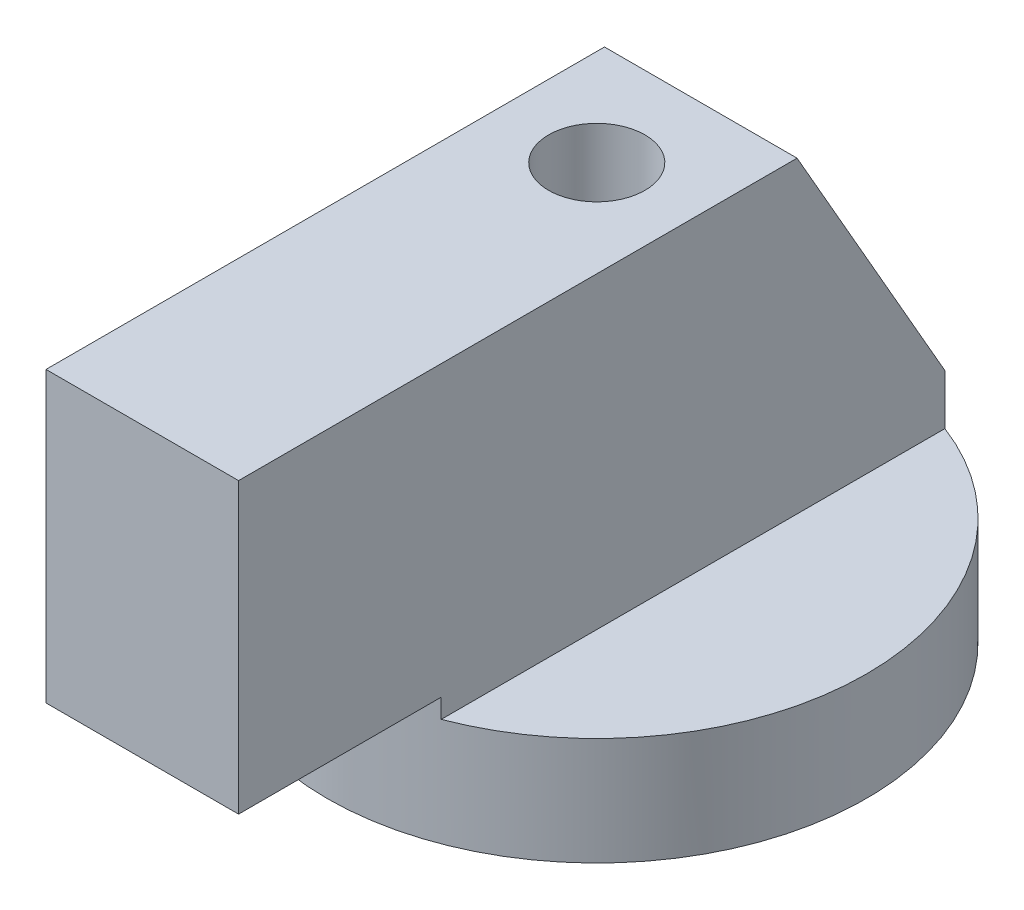
ISO-10303-21;
HEADER;
FILE_DESCRIPTION(('STEP AP214'),'2;1');
FILE_NAME('part.step','',(''),(''),'','','');
FILE_SCHEMA(('AUTOMOTIVE_DESIGN { 1 0 10303 214 1 1 1 1 }'));
ENDSEC;
DATA;
#1=APPLICATION_CONTEXT('core data for automotive mechanical design processes');
#2=APPLICATION_PROTOCOL_DEFINITION('international standard','automotive_design',2000,#1);
#3=PRODUCT_CONTEXT('',#1,'mechanical');
#4=PRODUCT('Part','Part','',(#3));
#5=PRODUCT_RELATED_PRODUCT_CATEGORY('part','',(#4));
#6=PRODUCT_DEFINITION_FORMATION('','',#4);
#7=PRODUCT_DEFINITION_CONTEXT('part definition',#1,'design');
#8=PRODUCT_DEFINITION('design','',#6,#7);
#9=PRODUCT_DEFINITION_SHAPE('','',#8);
#10=(LENGTH_UNIT() NAMED_UNIT(*) SI_UNIT(.MILLI.,.METRE.));
#11=(NAMED_UNIT(*) PLANE_ANGLE_UNIT() SI_UNIT($,.RADIAN.));
#12=(NAMED_UNIT(*) SI_UNIT($,.STERADIAN.) SOLID_ANGLE_UNIT());
#13=UNCERTAINTY_MEASURE_WITH_UNIT(LENGTH_MEASURE(1.E-05),#10,'distance_accuracy_value','');
#14=(GEOMETRIC_REPRESENTATION_CONTEXT(3) GLOBAL_UNCERTAINTY_ASSIGNED_CONTEXT((#13)) GLOBAL_UNIT_ASSIGNED_CONTEXT((#10,
#11,#12)) REPRESENTATION_CONTEXT('',''));
#15=CARTESIAN_POINT('',(0.,0.,0.));
#16=DIRECTION('',(0.,0.,1.));
#17=DIRECTION('',(1.,0.,0.));
#18=AXIS2_PLACEMENT_3D('',#15,#16,#17);
#19=CARTESIAN_POINT('',(5.,16.,-5.4));
#20=DIRECTION('',(0.,-0.497384112444042,0.867530428681468));
#21=DIRECTION('',(0.,-0.867530428681468,-0.497384112444042));
#22=AXIS2_PLACEMENT_3D('',#19,#20,#21);
#23=PLANE('',#22);
#24=DIRECTION('',(0.,0.867530428681468,0.497384112444042));
#25=VECTOR('',#24,1.);
#26=CARTESIAN_POINT('',(5.,16.,-5.4));
#27=LINE('',#26,#25);
#28=CARTESIAN_POINT('',(5.,2.61041250472904,-13.076696830622));
#29=VERTEX_POINT('',#28);
#30=CARTESIAN_POINT('',(5.,16.,-5.4));
#31=VERTEX_POINT('',#30);
#32=EDGE_CURVE('E184',#29,#31,#27,.T.);
#33=ORIENTED_EDGE('',*,*,#32,.F.);
#34=CARTESIAN_POINT('',(0.,25.4186046511628,0.));
#35=DIRECTION('',(0.,-0.497384112444042,0.867530428681468));
#36=DIRECTION('',(0.,-0.867530428681468,-0.497384112444042));
#37=AXIS2_PLACEMENT_3D('',#34,#35,#36);
#38=ELLIPSE('',#37,28.1472601350431,14.);
#39=CARTESIAN_POINT('',(-5.,2.61041250472904,-13.076696830622));
#40=VERTEX_POINT('',#39);
#41=EDGE_CURVE('E168',#40,#29,#38,.T.);
#42=ORIENTED_EDGE('',*,*,#41,.F.);
#43=DIRECTION('',(0.,0.867530428681468,0.497384112444042));
#44=VECTOR('',#43,1.);
#45=CARTESIAN_POINT('',(-5.,16.,-5.4));
#46=LINE('',#45,#44);
#47=CARTESIAN_POINT('',(-5.,16.,-5.4));
#48=VERTEX_POINT('',#47);
#49=EDGE_CURVE('E178',#40,#48,#46,.T.);
#50=ORIENTED_EDGE('',*,*,#49,.T.);
#51=DIRECTION('',(-1.,0.,0.));
#52=VECTOR('',#51,1.);
#53=CARTESIAN_POINT('',(5.,16.,-5.4));
#54=LINE('',#53,#52);
#55=EDGE_CURVE('E208',#31,#48,#54,.T.);
#56=ORIENTED_EDGE('',*,*,#55,.F.);
#57=EDGE_LOOP('',(#33,#42,#50,#56));
#58=FACE_BOUND('',#57,.T.);
#59=DIRECTION('',(0.,-0.867530428681468,-0.497384112444042));
#60=VECTOR('',#59,1.);
#61=CARTESIAN_POINT('',(1.75,11.4350751700863,-8.01722356915052));
#62=LINE('',#61,#60);
#63=CARTESIAN_POINT('',(1.75,11.4350751700863,-8.01722356915052));
#64=VERTEX_POINT('',#63);
#65=CARTESIAN_POINT('',(1.75,4.49483174063456,-11.9962964687029));
#66=VERTEX_POINT('',#65);
#67=EDGE_CURVE('E157',#64,#66,#62,.T.);
#68=ORIENTED_EDGE('',*,*,#67,.F.);
#69=DIRECTION('',(1.,0.,0.));
#70=VECTOR('',#69,1.);
#71=CARTESIAN_POINT('',(-1.75,11.4350751700863,-8.01722356915052));
#72=LINE('',#71,#70);
#73=CARTESIAN_POINT('',(-1.75,11.4350751700863,-8.01722356915051));
#74=VERTEX_POINT('',#73);
#75=EDGE_CURVE('E154',#74,#64,#72,.T.);
#76=ORIENTED_EDGE('',*,*,#75,.F.);
#77=DIRECTION('',(0.,0.867530428681468,0.497384112444042));
#78=VECTOR('',#77,1.);
#79=CARTESIAN_POINT('',(-1.75,11.4350751700863,-8.01722356915052));
#80=LINE('',#79,#78);
#81=CARTESIAN_POINT('',(-1.75,4.49483174063456,-11.9962964687029));
#82=VERTEX_POINT('',#81);
#83=EDGE_CURVE('E74',#82,#74,#80,.T.);
#84=ORIENTED_EDGE('',*,*,#83,.F.);
#85=DIRECTION('',(-1.,0.,0.));
#86=VECTOR('',#85,1.);
#87=CARTESIAN_POINT('',(-1.75,4.49483174063456,-11.9962964687029));
#88=LINE('',#87,#86);
#89=EDGE_CURVE('E69',#66,#82,#88,.T.);
#90=ORIENTED_EDGE('',*,*,#89,.F.);
#91=EDGE_LOOP('',(#68,#76,#84,#90));
#92=FACE_BOUND('',#91,.T.);
#93=ADVANCED_FACE('F54',(#58,#92),#23,.F.);
#94=CARTESIAN_POINT('',(5.,0.,0.));
#95=DIRECTION('',(-1.,0.,0.));
#96=DIRECTION('',(0.,0.,1.));
#97=AXIS2_PLACEMENT_3D('',#94,#95,#96);
#98=PLANE('',#97);
#99=DIRECTION('',(0.,-1.,0.));
#100=VECTOR('',#99,1.);
#101=CARTESIAN_POINT('',(5.,49.415040039527,-13.076696830622));
#102=LINE('',#101,#100);
#103=CARTESIAN_POINT('',(5.,0.,-13.076696830622));
#104=VERTEX_POINT('',#103);
#105=EDGE_CURVE('E173',#29,#104,#102,.T.);
#106=ORIENTED_EDGE('',*,*,#105,.F.);
#107=ORIENTED_EDGE('',*,*,#32,.T.);
#108=DIRECTION('',(0.,0.,1.));
#109=VECTOR('',#108,1.);
#110=CARTESIAN_POINT('',(5.,16.,23.6));
#111=LINE('',#110,#109);
#112=CARTESIAN_POINT('',(5.,16.,23.6));
#113=VERTEX_POINT('',#112);
#114=EDGE_CURVE('E186',#31,#113,#111,.T.);
#115=ORIENTED_EDGE('',*,*,#114,.T.);
#116=DIRECTION('',(0.,-1.,0.));
#117=VECTOR('',#116,1.);
#118=CARTESIAN_POINT('',(5.,1.,23.6));
#119=LINE('',#118,#117);
#120=CARTESIAN_POINT('',(5.,1.,23.6));
#121=VERTEX_POINT('',#120);
#122=EDGE_CURVE('E189',#113,#121,#119,.T.);
#123=ORIENTED_EDGE('',*,*,#122,.T.);
#124=DIRECTION('',(0.,0.,-1.));
#125=VECTOR('',#124,1.);
#126=CARTESIAN_POINT('',(5.,1.,14.));
#127=LINE('',#126,#125);
#128=CARTESIAN_POINT('',(5.,1.,13.076696830622));
#129=VERTEX_POINT('',#128);
#130=EDGE_CURVE('E191',#121,#129,#127,.T.);
#131=ORIENTED_EDGE('',*,*,#130,.T.);
#132=DIRECTION('',(0.,-1.,0.));
#133=VECTOR('',#132,1.);
#134=CARTESIAN_POINT('',(5.,49.415040039527,13.076696830622));
#135=LINE('',#134,#133);
#136=CARTESIAN_POINT('',(5.,0.,13.076696830622));
#137=VERTEX_POINT('',#136);
#138=EDGE_CURVE('E175',#137,#129,#135,.F.);
#139=ORIENTED_EDGE('',*,*,#138,.F.);
#140=DIRECTION('',(0.,0.,-1.));
#141=VECTOR('',#140,1.);
#142=CARTESIAN_POINT('',(5.,0.,-14.));
#143=LINE('',#142,#141);
#144=EDGE_CURVE('E179',#137,#104,#143,.T.);
#145=ORIENTED_EDGE('',*,*,#144,.T.);
#146=EDGE_LOOP('',(#106,#107,#115,#123,#131,#139,#145));
#147=FACE_BOUND('',#146,.T.);
#148=ADVANCED_FACE('F247',(#147),#98,.F.);
#149=CARTESIAN_POINT('',(-5.,0.,0.));
#150=DIRECTION('',(-1.,0.,0.));
#151=DIRECTION('',(0.,0.,1.));
#152=AXIS2_PLACEMENT_3D('',#149,#150,#151);
#153=PLANE('',#152);
#154=ORIENTED_EDGE('',*,*,#49,.F.);
#155=DIRECTION('',(0.,-1.,0.));
#156=VECTOR('',#155,1.);
#157=CARTESIAN_POINT('',(-5.,49.415040039527,-13.076696830622));
#158=LINE('',#157,#156);
#159=CARTESIAN_POINT('',(-5.,0.,-13.076696830622));
#160=VERTEX_POINT('',#159);
#161=EDGE_CURVE('E62',#40,#160,#158,.T.);
#162=ORIENTED_EDGE('',*,*,#161,.T.);
#163=DIRECTION('',(0.,0.,-1.));
#164=VECTOR('',#163,1.);
#165=CARTESIAN_POINT('',(-5.,0.,-14.));
#166=LINE('',#165,#164);
#167=CARTESIAN_POINT('',(-5.,0.,13.076696830622));
#168=VERTEX_POINT('',#167);
#169=EDGE_CURVE('E182',#168,#160,#166,.T.);
#170=ORIENTED_EDGE('',*,*,#169,.F.);
#171=DIRECTION('',(0.,-1.,0.));
#172=VECTOR('',#171,1.);
#173=CARTESIAN_POINT('',(-5.,49.415040039527,13.076696830622));
#174=LINE('',#173,#172);
#175=CARTESIAN_POINT('',(-5.,1.,13.076696830622));
#176=VERTEX_POINT('',#175);
#177=EDGE_CURVE('E13',#168,#176,#174,.F.);
#178=ORIENTED_EDGE('',*,*,#177,.T.);
#179=DIRECTION('',(0.,0.,-1.));
#180=VECTOR('',#179,1.);
#181=CARTESIAN_POINT('',(-5.,1.,14.));
#182=LINE('',#181,#180);
#183=CARTESIAN_POINT('',(-5.,1.,23.6));
#184=VERTEX_POINT('',#183);
#185=EDGE_CURVE('E187',#184,#176,#182,.T.);
#186=ORIENTED_EDGE('',*,*,#185,.F.);
#187=DIRECTION('',(0.,-1.,0.));
#188=VECTOR('',#187,1.);
#189=CARTESIAN_POINT('',(-5.,1.,23.6));
#190=LINE('',#189,#188);
#191=CARTESIAN_POINT('',(-5.,16.,23.6));
#192=VERTEX_POINT('',#191);
#193=EDGE_CURVE('E199',#192,#184,#190,.T.);
#194=ORIENTED_EDGE('',*,*,#193,.F.);
#195=DIRECTION('',(0.,0.,1.));
#196=VECTOR('',#195,1.);
#197=CARTESIAN_POINT('',(-5.,16.,23.6));
#198=LINE('',#197,#196);
#199=EDGE_CURVE('E197',#48,#192,#198,.T.);
#200=ORIENTED_EDGE('',*,*,#199,.F.);
#201=EDGE_LOOP('',(#154,#162,#170,#178,#186,#194,#200));
#202=FACE_BOUND('',#201,.T.);
#203=ADVANCED_FACE('F219',(#202),#153,.T.);
#204=CARTESIAN_POINT('',(0.,0.,0.));
#205=DIRECTION('',(0.,1.,0.));
#206=DIRECTION('',(0.,0.,1.));
#207=AXIS2_PLACEMENT_3D('',#204,#205,#206);
#208=PLANE('',#207);
#209=CARTESIAN_POINT('',(0.,0.,0.));
#210=DIRECTION('',(0.,1.,0.));
#211=DIRECTION('',(0.,0.,1.));
#212=AXIS2_PLACEMENT_3D('',#209,#210,#211);
#213=CIRCLE('',#212,14.);
#214=EDGE_CURVE('E211',#160,#168,#213,.T.);
#215=ORIENTED_EDGE('',*,*,#214,.T.);
#216=ORIENTED_EDGE('',*,*,#169,.T.);
#217=EDGE_LOOP('',(#215,#216));
#218=FACE_BOUND('',#217,.T.);
#219=ADVANCED_FACE('F225',(#218),#208,.T.);
#220=CARTESIAN_POINT('',(0.,-5.6,0.));
#221=DIRECTION('',(0.,1.,0.));
#222=DIRECTION('',(0.,0.,1.));
#223=AXIS2_PLACEMENT_3D('',#220,#221,#222);
#224=CYLINDRICAL_SURFACE('',#223,14.);
#225=CARTESIAN_POINT('',(0.,-5.6,0.));
#226=DIRECTION('',(0.,1.,0.));
#227=DIRECTION('',(0.,0.,1.));
#228=AXIS2_PLACEMENT_3D('',#225,#226,#227);
#229=CIRCLE('',#228,14.);
#230=CARTESIAN_POINT('',(0.,-5.6,14.));
#231=VERTEX_POINT('',#230);
#232=EDGE_CURVE('E183',#231,#231,#229,.T.);
#233=ORIENTED_EDGE('',*,*,#232,.T.);
#234=EDGE_LOOP('',(#233));
#235=FACE_BOUND('',#234,.T.);
#236=ORIENTED_EDGE('',*,*,#41,.T.);
#237=ORIENTED_EDGE('',*,*,#105,.T.);
#238=EDGE_CURVE('E214',#137,#104,#213,.T.);
#239=ORIENTED_EDGE('',*,*,#238,.F.);
#240=ORIENTED_EDGE('',*,*,#138,.T.);
#241=CARTESIAN_POINT('',(0.,1.00000000000001,0.));
#242=DIRECTION('',(0.,1.,0.));
#243=DIRECTION('',(0.,0.,1.));
#244=AXIS2_PLACEMENT_3D('',#241,#242,#243);
#245=CIRCLE('',#244,14.);
#246=EDGE_CURVE('E171',#129,#176,#245,.F.);
#247=ORIENTED_EDGE('',*,*,#246,.T.);
#248=ORIENTED_EDGE('',*,*,#177,.F.);
#249=ORIENTED_EDGE('',*,*,#214,.F.);
#250=ORIENTED_EDGE('',*,*,#161,.F.);
#251=EDGE_LOOP('',(#236,#237,#239,#240,#247,#248,#249,#250));
#252=FACE_BOUND('',#251,.T.);
#253=ADVANCED_FACE('F56',(#235,#252),#224,.T.);
#254=CARTESIAN_POINT('',(0.,-5.6,0.));
#255=DIRECTION('',(0.,1.,0.));
#256=DIRECTION('',(0.,0.,1.));
#257=AXIS2_PLACEMENT_3D('',#254,#255,#256);
#258=PLANE('',#257);
#259=CARTESIAN_POINT('',(0.,-5.6,0.));
#260=DIRECTION('',(0.,-1.,0.));
#261=DIRECTION('',(0.,0.,-1.));
#262=AXIS2_PLACEMENT_3D('',#259,#260,#261);
#263=CIRCLE('',#262,2.5);
#264=CARTESIAN_POINT('',(0.,-5.6,-2.5));
#265=VERTEX_POINT('',#264);
#266=EDGE_CURVE('E158',#265,#265,#263,.T.);
#267=ORIENTED_EDGE('',*,*,#266,.F.);
#268=EDGE_LOOP('',(#267));
#269=FACE_BOUND('',#268,.T.);
#270=ORIENTED_EDGE('',*,*,#232,.F.);
#271=EDGE_LOOP('',(#270));
#272=FACE_BOUND('',#271,.T.);
#273=ADVANCED_FACE('F252',(#269,#272),#258,.F.);
#274=ORIENTED_EDGE('',*,*,#144,.F.);
#275=ORIENTED_EDGE('',*,*,#238,.T.);
#276=EDGE_LOOP('',(#274,#275));
#277=FACE_BOUND('',#276,.T.);
#278=ADVANCED_FACE('F250',(#277),#208,.T.);
#279=CARTESIAN_POINT('',(5.,16.,23.6));
#280=DIRECTION('',(0.,-1.,0.));
#281=DIRECTION('',(0.,0.,-1.));
#282=AXIS2_PLACEMENT_3D('',#279,#280,#281);
#283=PLANE('',#282);
#284=CARTESIAN_POINT('',(0.,16.,0.));
#285=DIRECTION('',(0.,-1.,0.));
#286=DIRECTION('',(0.,0.,-1.));
#287=AXIS2_PLACEMENT_3D('',#284,#285,#286);
#288=CIRCLE('',#287,2.5);
#289=CARTESIAN_POINT('',(0.,16.,-2.5));
#290=VERTEX_POINT('',#289);
#291=EDGE_CURVE('E161',#290,#290,#288,.T.);
#292=ORIENTED_EDGE('',*,*,#291,.T.);
#293=EDGE_LOOP('',(#292));
#294=FACE_BOUND('',#293,.T.);
#295=ORIENTED_EDGE('',*,*,#199,.T.);
#296=DIRECTION('',(-1.,0.,0.));
#297=VECTOR('',#296,1.);
#298=CARTESIAN_POINT('',(5.,16.,23.6));
#299=LINE('',#298,#297);
#300=EDGE_CURVE('E205',#113,#192,#299,.T.);
#301=ORIENTED_EDGE('',*,*,#300,.F.);
#302=ORIENTED_EDGE('',*,*,#114,.F.);
#303=ORIENTED_EDGE('',*,*,#55,.T.);
#304=EDGE_LOOP('',(#295,#301,#302,#303));
#305=FACE_BOUND('',#304,.T.);
#306=ADVANCED_FACE('F239',(#294,#305),#283,.F.);
#307=CARTESIAN_POINT('',(5.,1.,23.6));
#308=DIRECTION('',(0.,0.,-1.));
#309=DIRECTION('',(-1.,0.,0.));
#310=AXIS2_PLACEMENT_3D('',#307,#308,#309);
#311=PLANE('',#310);
#312=ORIENTED_EDGE('',*,*,#193,.T.);
#313=DIRECTION('',(-1.,0.,0.));
#314=VECTOR('',#313,1.);
#315=CARTESIAN_POINT('',(5.,1.,23.6));
#316=LINE('',#315,#314);
#317=EDGE_CURVE('E193',#121,#184,#316,.T.);
#318=ORIENTED_EDGE('',*,*,#317,.F.);
#319=ORIENTED_EDGE('',*,*,#122,.F.);
#320=ORIENTED_EDGE('',*,*,#300,.T.);
#321=EDGE_LOOP('',(#312,#318,#319,#320));
#322=FACE_BOUND('',#321,.T.);
#323=ADVANCED_FACE('F235',(#322),#311,.F.);
#324=CARTESIAN_POINT('',(5.,1.,14.));
#325=DIRECTION('',(0.,1.,0.));
#326=DIRECTION('',(0.,0.,1.));
#327=AXIS2_PLACEMENT_3D('',#324,#325,#326);
#328=PLANE('',#327);
#329=ORIENTED_EDGE('',*,*,#185,.T.);
#330=ORIENTED_EDGE('',*,*,#246,.F.);
#331=ORIENTED_EDGE('',*,*,#130,.F.);
#332=ORIENTED_EDGE('',*,*,#317,.T.);
#333=EDGE_LOOP('',(#329,#330,#331,#332));
#334=FACE_BOUND('',#333,.T.);
#335=ADVANCED_FACE('F230',(#334),#328,.F.);
#336=CARTESIAN_POINT('',(0.,16.,0.));
#337=DIRECTION('',(0.,-1.,0.));
#338=DIRECTION('',(0.,0.,-1.));
#339=AXIS2_PLACEMENT_3D('',#336,#337,#338);
#340=CYLINDRICAL_SURFACE('',#339,2.5);
#341=ORIENTED_EDGE('',*,*,#291,.F.);
#342=EDGE_LOOP('',(#341));
#343=FACE_BOUND('',#342,.T.);
#344=ORIENTED_EDGE('',*,*,#266,.T.);
#345=EDGE_LOOP('',(#344));
#346=FACE_BOUND('',#345,.T.);
#347=ADVANCED_FACE('F275',(#343,#346),#340,.F.);
#348=CARTESIAN_POINT('',(1.75,11.4848135813307,-8.10397661201867));
#349=DIRECTION('',(-1.,0.,0.));
#350=DIRECTION('',(0.,-1.,0.));
#351=AXIS2_PLACEMENT_3D('',#348,#349,#350);
#352=PLANE('',#351);
#353=ORIENTED_EDGE('',*,*,#67,.T.);
#354=DIRECTION('',(0.,-0.497384112444042,0.867530428681468));
#355=VECTOR('',#354,1.);
#356=CARTESIAN_POINT('',(1.75,4.54457015187897,-12.083049511571));
#357=LINE('',#356,#355);
#358=CARTESIAN_POINT('',(1.75,4.54457015187897,-12.083049511571));
#359=VERTEX_POINT('',#358);
#360=EDGE_CURVE('E138',#359,#66,#357,.T.);
#361=ORIENTED_EDGE('',*,*,#360,.F.);
#362=DIRECTION('',(0.,-0.867530428681468,-0.497384112444042));
#363=VECTOR('',#362,1.);
#364=CARTESIAN_POINT('',(1.75,11.4848135813307,-8.10397661201867));
#365=LINE('',#364,#363);
#366=CARTESIAN_POINT('',(1.75,11.4848135813307,-8.10397661201867));
#367=VERTEX_POINT('',#366);
#368=EDGE_CURVE('E145',#367,#359,#365,.T.);
#369=ORIENTED_EDGE('',*,*,#368,.F.);
#370=DIRECTION('',(0.,-0.497384112444042,0.867530428681468));
#371=VECTOR('',#370,1.);
#372=CARTESIAN_POINT('',(1.75,11.4848135813307,-8.10397661201867));
#373=LINE('',#372,#371);
#374=EDGE_CURVE('E410',#367,#64,#373,.T.);
#375=ORIENTED_EDGE('',*,*,#374,.T.);
#376=EDGE_LOOP('',(#353,#361,#369,#375));
#377=FACE_BOUND('',#376,.T.);
#378=ADVANCED_FACE('F156',(#377),#352,.F.);
#379=CARTESIAN_POINT('',(-1.75,4.54457015187897,-12.083049511571));
#380=DIRECTION('',(0.,0.867530428681468,0.497384112444042));
#381=DIRECTION('',(0.,-0.497384112444042,0.867530428681468));
#382=AXIS2_PLACEMENT_3D('',#379,#380,#381);
#383=PLANE('',#382);
#384=ORIENTED_EDGE('',*,*,#89,.T.);
#385=DIRECTION('',(0.,-0.497384112444042,0.867530428681468));
#386=VECTOR('',#385,1.);
#387=CARTESIAN_POINT('',(-1.75,4.54457015187897,-12.083049511571));
#388=LINE('',#387,#386);
#389=CARTESIAN_POINT('',(-1.75,4.54457015187897,-12.083049511571));
#390=VERTEX_POINT('',#389);
#391=EDGE_CURVE('E141',#390,#82,#388,.T.);
#392=ORIENTED_EDGE('',*,*,#391,.F.);
#393=DIRECTION('',(-1.,0.,0.));
#394=VECTOR('',#393,1.);
#395=CARTESIAN_POINT('',(-1.75,4.54457015187897,-12.083049511571));
#396=LINE('',#395,#394);
#397=EDGE_CURVE('E134',#359,#390,#396,.T.);
#398=ORIENTED_EDGE('',*,*,#397,.F.);
#399=ORIENTED_EDGE('',*,*,#360,.T.);
#400=EDGE_LOOP('',(#384,#392,#398,#399));
#401=FACE_BOUND('',#400,.T.);
#402=ADVANCED_FACE('F136',(#401),#383,.F.);
#403=CARTESIAN_POINT('',(-1.75,11.4848135813307,-8.10397661201867));
#404=DIRECTION('',(1.,0.,0.));
#405=DIRECTION('',(0.,1.,0.));
#406=AXIS2_PLACEMENT_3D('',#403,#404,#405);
#407=PLANE('',#406);
#408=ORIENTED_EDGE('',*,*,#83,.T.);
#409=DIRECTION('',(0.,-0.497384112444042,0.867530428681468));
#410=VECTOR('',#409,1.);
#411=CARTESIAN_POINT('',(-1.75,11.4848135813307,-8.10397661201867));
#412=LINE('',#411,#410);
#413=CARTESIAN_POINT('',(-1.75,11.4848135813307,-8.10397661201867));
#414=VERTEX_POINT('',#413);
#415=EDGE_CURVE('E163',#414,#74,#412,.T.);
#416=ORIENTED_EDGE('',*,*,#415,.F.);
#417=DIRECTION('',(0.,0.867530428681468,0.497384112444042));
#418=VECTOR('',#417,1.);
#419=CARTESIAN_POINT('',(-1.75,11.4848135813307,-8.10397661201867));
#420=LINE('',#419,#418);
#421=EDGE_CURVE('E144',#390,#414,#420,.T.);
#422=ORIENTED_EDGE('',*,*,#421,.F.);
#423=ORIENTED_EDGE('',*,*,#391,.T.);
#424=EDGE_LOOP('',(#408,#416,#422,#423));
#425=FACE_BOUND('',#424,.T.);
#426=ADVANCED_FACE('F285',(#425),#407,.F.);
#427=CARTESIAN_POINT('',(-1.75,11.4848135813307,-8.10397661201867));
#428=DIRECTION('',(0.,-0.867530428681468,-0.497384112444042));
#429=DIRECTION('',(0.,0.497384112444042,-0.867530428681468));
#430=AXIS2_PLACEMENT_3D('',#427,#428,#429);
#431=PLANE('',#430);
#432=ORIENTED_EDGE('',*,*,#75,.T.);
#433=ORIENTED_EDGE('',*,*,#374,.F.);
#434=DIRECTION('',(1.,0.,0.));
#435=VECTOR('',#434,1.);
#436=CARTESIAN_POINT('',(-1.75,11.4848135813307,-8.10397661201867));
#437=LINE('',#436,#435);
#438=EDGE_CURVE('E150',#414,#367,#437,.T.);
#439=ORIENTED_EDGE('',*,*,#438,.F.);
#440=ORIENTED_EDGE('',*,*,#415,.T.);
#441=EDGE_LOOP('',(#432,#433,#439,#440));
#442=FACE_BOUND('',#441,.T.);
#443=ADVANCED_FACE('F288',(#442),#431,.F.);
#444=CARTESIAN_POINT('',(0.,6.3380712985872,-11.0547755207916));
#445=DIRECTION('',(0.,-0.497384112444042,0.867530428681468));
#446=DIRECTION('',(0.,-0.867530428681468,-0.497384112444042));
#447=AXIS2_PLACEMENT_3D('',#444,#445,#446);
#448=PLANE('',#447);
#449=ORIENTED_EDGE('',*,*,#368,.T.);
#450=ORIENTED_EDGE('',*,*,#397,.T.);
#451=ORIENTED_EDGE('',*,*,#421,.T.);
#452=ORIENTED_EDGE('',*,*,#438,.T.);
#453=EDGE_LOOP('',(#449,#450,#451,#452));
#454=FACE_BOUND('',#453,.T.);
#455=ADVANCED_FACE('F148',(#454),#448,.F.);
#456=CLOSED_SHELL('',(#93,#148,#203,#219,#253,#273,#278,#306,#323,#335,#347,#378,#402,#426,#443,#455));
#457=MANIFOLD_SOLID_BREP('B2',#456);
#458=ADVANCED_BREP_SHAPE_REPRESENTATION('',(#18,#457),#14);
#459=SHAPE_DEFINITION_REPRESENTATION(#9,#458);
ENDSEC;
END-ISO-10303-21;
